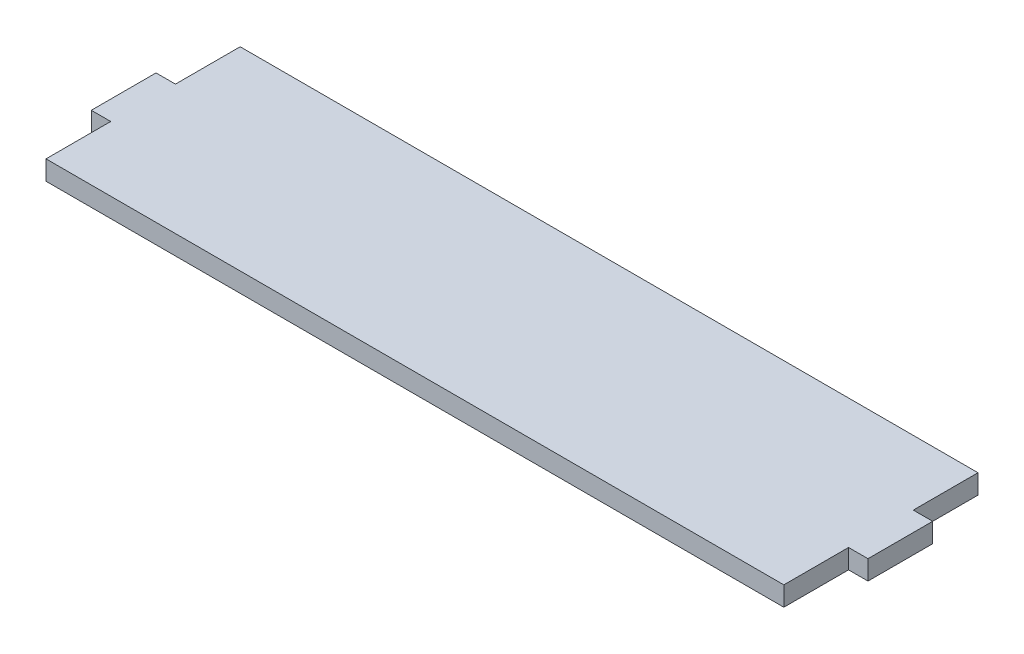
ISO-10303-21;
HEADER;
FILE_DESCRIPTION(('STEP AP214'),'2;1');
FILE_NAME('part.step','',(''),(''),'','','');
FILE_SCHEMA(('AUTOMOTIVE_DESIGN { 1 0 10303 214 1 1 1 1 }'));
ENDSEC;
DATA;
#1=APPLICATION_CONTEXT('core data for automotive mechanical design processes');
#2=APPLICATION_PROTOCOL_DEFINITION('international standard','automotive_design',2000,#1);
#3=PRODUCT_CONTEXT('',#1,'mechanical');
#4=PRODUCT('Part','Part','',(#3));
#5=PRODUCT_RELATED_PRODUCT_CATEGORY('part','',(#4));
#6=PRODUCT_DEFINITION_FORMATION('','',#4);
#7=PRODUCT_DEFINITION_CONTEXT('part definition',#1,'design');
#8=PRODUCT_DEFINITION('design','',#6,#7);
#9=PRODUCT_DEFINITION_SHAPE('','',#8);
#10=(LENGTH_UNIT() NAMED_UNIT(*) SI_UNIT(.MILLI.,.METRE.));
#11=(NAMED_UNIT(*) PLANE_ANGLE_UNIT() SI_UNIT($,.RADIAN.));
#12=(NAMED_UNIT(*) SI_UNIT($,.STERADIAN.) SOLID_ANGLE_UNIT());
#13=UNCERTAINTY_MEASURE_WITH_UNIT(LENGTH_MEASURE(1.E-05),#10,'distance_accuracy_value','');
#14=(GEOMETRIC_REPRESENTATION_CONTEXT(3) GLOBAL_UNCERTAINTY_ASSIGNED_CONTEXT((#13)) GLOBAL_UNIT_ASSIGNED_CONTEXT((#10,
#11,#12)) REPRESENTATION_CONTEXT('',''));
#15=CARTESIAN_POINT('',(0.,0.,0.));
#16=DIRECTION('',(0.,0.,1.));
#17=DIRECTION('',(1.,0.,0.));
#18=AXIS2_PLACEMENT_3D('',#15,#16,#17);
#19=CARTESIAN_POINT('',(-57.,3.,-4.99999999999996));
#20=DIRECTION('',(1.,0.,0.));
#21=DIRECTION('',(0.,0.,-1.));
#22=AXIS2_PLACEMENT_3D('',#19,#20,#21);
#23=PLANE('',#22);
#24=DIRECTION('',(0.,0.,1.));
#25=VECTOR('',#24,1.);
#26=CARTESIAN_POINT('',(-57.,0.,-4.99999999999996));
#27=LINE('',#26,#25);
#28=CARTESIAN_POINT('',(-57.,0.,-15.));
#29=VERTEX_POINT('',#28);
#30=CARTESIAN_POINT('',(-57.,0.,-4.99999999999996));
#31=VERTEX_POINT('',#30);
#32=EDGE_CURVE('E155',#29,#31,#27,.T.);
#33=ORIENTED_EDGE('',*,*,#32,.T.);
#34=DIRECTION('',(0.,-1.,0.));
#35=VECTOR('',#34,1.);
#36=CARTESIAN_POINT('',(-57.,3.,-4.99999999999996));
#37=LINE('',#36,#35);
#38=CARTESIAN_POINT('',(-57.,3.,-4.99999999999996));
#39=VERTEX_POINT('',#38);
#40=EDGE_CURVE('E11',#39,#31,#37,.T.);
#41=ORIENTED_EDGE('',*,*,#40,.F.);
#42=DIRECTION('',(0.,0.,1.));
#43=VECTOR('',#42,1.);
#44=CARTESIAN_POINT('',(-57.,3.,-4.99999999999996));
#45=LINE('',#44,#43);
#46=CARTESIAN_POINT('',(-57.,3.,-15.));
#47=VERTEX_POINT('',#46);
#48=EDGE_CURVE('E177',#47,#39,#45,.T.);
#49=ORIENTED_EDGE('',*,*,#48,.F.);
#50=DIRECTION('',(0.,-1.,0.));
#51=VECTOR('',#50,1.);
#52=CARTESIAN_POINT('',(-57.,3.,-15.));
#53=LINE('',#52,#51);
#54=EDGE_CURVE('E151',#47,#29,#53,.T.);
#55=ORIENTED_EDGE('',*,*,#54,.T.);
#56=EDGE_LOOP('',(#33,#41,#49,#55));
#57=FACE_BOUND('',#56,.T.);
#58=ADVANCED_FACE('F35',(#57),#23,.F.);
#59=CARTESIAN_POINT('',(-57.,3.,-4.99999999999996));
#60=DIRECTION('',(0.,0.,1.));
#61=DIRECTION('',(1.,0.,0.));
#62=AXIS2_PLACEMENT_3D('',#59,#60,#61);
#63=PLANE('',#62);
#64=DIRECTION('',(-1.,0.,0.));
#65=VECTOR('',#64,1.);
#66=CARTESIAN_POINT('',(-57.,0.,-4.99999999999996));
#67=LINE('',#66,#65);
#68=CARTESIAN_POINT('',(-60.,0.,-5.));
#69=VERTEX_POINT('',#68);
#70=EDGE_CURVE('E158',#31,#69,#67,.T.);
#71=ORIENTED_EDGE('',*,*,#70,.T.);
#72=DIRECTION('',(0.,-1.,0.));
#73=VECTOR('',#72,1.);
#74=CARTESIAN_POINT('',(-60.,3.,-5.));
#75=LINE('',#74,#73);
#76=CARTESIAN_POINT('',(-60.,3.,-5.));
#77=VERTEX_POINT('',#76);
#78=EDGE_CURVE('E43',#77,#69,#75,.T.);
#79=ORIENTED_EDGE('',*,*,#78,.F.);
#80=DIRECTION('',(-1.,0.,0.));
#81=VECTOR('',#80,1.);
#82=CARTESIAN_POINT('',(-57.,3.,-4.99999999999996));
#83=LINE('',#82,#81);
#84=EDGE_CURVE('E106',#39,#77,#83,.T.);
#85=ORIENTED_EDGE('',*,*,#84,.F.);
#86=ORIENTED_EDGE('',*,*,#40,.T.);
#87=EDGE_LOOP('',(#71,#79,#85,#86));
#88=FACE_BOUND('',#87,.T.);
#89=ADVANCED_FACE('F255',(#88),#63,.F.);
#90=CARTESIAN_POINT('',(-60.,3.,-5.));
#91=DIRECTION('',(1.,0.,0.));
#92=DIRECTION('',(0.,0.,-1.));
#93=AXIS2_PLACEMENT_3D('',#90,#91,#92);
#94=PLANE('',#93);
#95=DIRECTION('',(0.,0.,1.));
#96=VECTOR('',#95,1.);
#97=CARTESIAN_POINT('',(-60.,0.,-5.));
#98=LINE('',#97,#96);
#99=CARTESIAN_POINT('',(-60.,0.,5.));
#100=VERTEX_POINT('',#99);
#101=EDGE_CURVE('E160',#69,#100,#98,.T.);
#102=ORIENTED_EDGE('',*,*,#101,.T.);
#103=DIRECTION('',(0.,-1.,0.));
#104=VECTOR('',#103,1.);
#105=CARTESIAN_POINT('',(-60.,3.,5.));
#106=LINE('',#105,#104);
#107=CARTESIAN_POINT('',(-60.,3.,5.));
#108=VERTEX_POINT('',#107);
#109=EDGE_CURVE('E196',#108,#100,#106,.T.);
#110=ORIENTED_EDGE('',*,*,#109,.F.);
#111=DIRECTION('',(0.,0.,1.));
#112=VECTOR('',#111,1.);
#113=CARTESIAN_POINT('',(-60.,3.,-5.));
#114=LINE('',#113,#112);
#115=EDGE_CURVE('E204',#77,#108,#114,.T.);
#116=ORIENTED_EDGE('',*,*,#115,.F.);
#117=ORIENTED_EDGE('',*,*,#78,.T.);
#118=EDGE_LOOP('',(#102,#110,#116,#117));
#119=FACE_BOUND('',#118,.T.);
#120=ADVANCED_FACE('F202',(#119),#94,.F.);
#121=CARTESIAN_POINT('',(-60.,3.,5.));
#122=DIRECTION('',(0.,0.,-1.));
#123=DIRECTION('',(-1.,0.,0.));
#124=AXIS2_PLACEMENT_3D('',#121,#122,#123);
#125=PLANE('',#124);
#126=DIRECTION('',(1.,0.,0.));
#127=VECTOR('',#126,1.);
#128=CARTESIAN_POINT('',(-60.,0.,5.));
#129=LINE('',#128,#127);
#130=CARTESIAN_POINT('',(-57.,0.,4.99999999999995));
#131=VERTEX_POINT('',#130);
#132=EDGE_CURVE('E162',#100,#131,#129,.T.);
#133=ORIENTED_EDGE('',*,*,#132,.T.);
#134=DIRECTION('',(0.,-1.,0.));
#135=VECTOR('',#134,1.);
#136=CARTESIAN_POINT('',(-57.,3.,4.99999999999995));
#137=LINE('',#136,#135);
#138=CARTESIAN_POINT('',(-57.,3.,4.99999999999995));
#139=VERTEX_POINT('',#138);
#140=EDGE_CURVE('E193',#139,#131,#137,.T.);
#141=ORIENTED_EDGE('',*,*,#140,.F.);
#142=DIRECTION('',(1.,0.,0.));
#143=VECTOR('',#142,1.);
#144=CARTESIAN_POINT('',(-60.,3.,5.));
#145=LINE('',#144,#143);
#146=EDGE_CURVE('E222',#108,#139,#145,.T.);
#147=ORIENTED_EDGE('',*,*,#146,.F.);
#148=ORIENTED_EDGE('',*,*,#109,.T.);
#149=EDGE_LOOP('',(#133,#141,#147,#148));
#150=FACE_BOUND('',#149,.T.);
#151=ADVANCED_FACE('F213',(#150),#125,.F.);
#152=CARTESIAN_POINT('',(-57.,3.,15.));
#153=DIRECTION('',(1.,0.,0.));
#154=DIRECTION('',(0.,0.,-1.));
#155=AXIS2_PLACEMENT_3D('',#152,#153,#154);
#156=PLANE('',#155);
#157=DIRECTION('',(0.,0.,1.));
#158=VECTOR('',#157,1.);
#159=CARTESIAN_POINT('',(-57.,0.,15.));
#160=LINE('',#159,#158);
#161=CARTESIAN_POINT('',(-57.,0.,15.));
#162=VERTEX_POINT('',#161);
#163=EDGE_CURVE('E164',#131,#162,#160,.T.);
#164=ORIENTED_EDGE('',*,*,#163,.T.);
#165=DIRECTION('',(0.,-1.,0.));
#166=VECTOR('',#165,1.);
#167=CARTESIAN_POINT('',(-57.,3.,15.));
#168=LINE('',#167,#166);
#169=CARTESIAN_POINT('',(-57.,3.,15.));
#170=VERTEX_POINT('',#169);
#171=EDGE_CURVE('E190',#170,#162,#168,.T.);
#172=ORIENTED_EDGE('',*,*,#171,.F.);
#173=DIRECTION('',(0.,0.,1.));
#174=VECTOR('',#173,1.);
#175=CARTESIAN_POINT('',(-57.,3.,15.));
#176=LINE('',#175,#174);
#177=EDGE_CURVE('E219',#139,#170,#176,.T.);
#178=ORIENTED_EDGE('',*,*,#177,.F.);
#179=ORIENTED_EDGE('',*,*,#140,.T.);
#180=EDGE_LOOP('',(#164,#172,#178,#179));
#181=FACE_BOUND('',#180,.T.);
#182=ADVANCED_FACE('F217',(#181),#156,.F.);
#183=CARTESIAN_POINT('',(57.,3.,15.));
#184=DIRECTION('',(0.,0.,-1.));
#185=DIRECTION('',(-1.,0.,0.));
#186=AXIS2_PLACEMENT_3D('',#183,#184,#185);
#187=PLANE('',#186);
#188=DIRECTION('',(1.,0.,0.));
#189=VECTOR('',#188,1.);
#190=CARTESIAN_POINT('',(57.,0.,15.));
#191=LINE('',#190,#189);
#192=CARTESIAN_POINT('',(57.,0.,15.));
#193=VERTEX_POINT('',#192);
#194=EDGE_CURVE('E166',#162,#193,#191,.T.);
#195=ORIENTED_EDGE('',*,*,#194,.T.);
#196=DIRECTION('',(0.,-1.,0.));
#197=VECTOR('',#196,1.);
#198=CARTESIAN_POINT('',(57.,3.,15.));
#199=LINE('',#198,#197);
#200=CARTESIAN_POINT('',(57.,3.,15.));
#201=VERTEX_POINT('',#200);
#202=EDGE_CURVE('E187',#201,#193,#199,.T.);
#203=ORIENTED_EDGE('',*,*,#202,.F.);
#204=DIRECTION('',(1.,0.,0.));
#205=VECTOR('',#204,1.);
#206=CARTESIAN_POINT('',(57.,3.,15.));
#207=LINE('',#206,#205);
#208=EDGE_CURVE('E221',#170,#201,#207,.T.);
#209=ORIENTED_EDGE('',*,*,#208,.F.);
#210=ORIENTED_EDGE('',*,*,#171,.T.);
#211=EDGE_LOOP('',(#195,#203,#209,#210));
#212=FACE_BOUND('',#211,.T.);
#213=ADVANCED_FACE('F268',(#212),#187,.F.);
#214=CARTESIAN_POINT('',(57.,3.,15.));
#215=DIRECTION('',(-1.,0.,0.));
#216=DIRECTION('',(0.,0.,1.));
#217=AXIS2_PLACEMENT_3D('',#214,#215,#216);
#218=PLANE('',#217);
#219=DIRECTION('',(0.,0.,-1.));
#220=VECTOR('',#219,1.);
#221=CARTESIAN_POINT('',(57.,0.,15.));
#222=LINE('',#221,#220);
#223=CARTESIAN_POINT('',(57.,0.,4.99999999999994));
#224=VERTEX_POINT('',#223);
#225=EDGE_CURVE('E168',#193,#224,#222,.T.);
#226=ORIENTED_EDGE('',*,*,#225,.T.);
#227=DIRECTION('',(0.,-1.,0.));
#228=VECTOR('',#227,1.);
#229=CARTESIAN_POINT('',(57.,3.,4.99999999999994));
#230=LINE('',#229,#228);
#231=CARTESIAN_POINT('',(57.,3.,4.99999999999994));
#232=VERTEX_POINT('',#231);
#233=EDGE_CURVE('E184',#232,#224,#230,.T.);
#234=ORIENTED_EDGE('',*,*,#233,.F.);
#235=DIRECTION('',(0.,0.,-1.));
#236=VECTOR('',#235,1.);
#237=CARTESIAN_POINT('',(57.,3.,15.));
#238=LINE('',#237,#236);
#239=EDGE_CURVE('E224',#201,#232,#238,.T.);
#240=ORIENTED_EDGE('',*,*,#239,.F.);
#241=ORIENTED_EDGE('',*,*,#202,.T.);
#242=EDGE_LOOP('',(#226,#234,#240,#241));
#243=FACE_BOUND('',#242,.T.);
#244=ADVANCED_FACE('F271',(#243),#218,.F.);
#245=CARTESIAN_POINT('',(60.,3.,4.99999999999998));
#246=DIRECTION('',(0.,0.,-1.));
#247=DIRECTION('',(-1.,0.,0.));
#248=AXIS2_PLACEMENT_3D('',#245,#246,#247);
#249=PLANE('',#248);
#250=DIRECTION('',(1.,0.,0.));
#251=VECTOR('',#250,1.);
#252=CARTESIAN_POINT('',(60.,0.,4.99999999999998));
#253=LINE('',#252,#251);
#254=CARTESIAN_POINT('',(60.,0.,4.99999999999998));
#255=VERTEX_POINT('',#254);
#256=EDGE_CURVE('E170',#224,#255,#253,.T.);
#257=ORIENTED_EDGE('',*,*,#256,.T.);
#258=DIRECTION('',(0.,-1.,0.));
#259=VECTOR('',#258,1.);
#260=CARTESIAN_POINT('',(60.,3.,4.99999999999998));
#261=LINE('',#260,#259);
#262=CARTESIAN_POINT('',(60.,3.,4.99999999999998));
#263=VERTEX_POINT('',#262);
#264=EDGE_CURVE('E181',#263,#255,#261,.T.);
#265=ORIENTED_EDGE('',*,*,#264,.F.);
#266=DIRECTION('',(1.,0.,0.));
#267=VECTOR('',#266,1.);
#268=CARTESIAN_POINT('',(60.,3.,4.99999999999998));
#269=LINE('',#268,#267);
#270=EDGE_CURVE('E230',#232,#263,#269,.T.);
#271=ORIENTED_EDGE('',*,*,#270,.F.);
#272=ORIENTED_EDGE('',*,*,#233,.T.);
#273=EDGE_LOOP('',(#257,#265,#271,#272));
#274=FACE_BOUND('',#273,.T.);
#275=ADVANCED_FACE('F236',(#274),#249,.F.);
#276=CARTESIAN_POINT('',(60.,3.,-4.99999999999999));
#277=DIRECTION('',(-1.,0.,0.));
#278=DIRECTION('',(0.,0.,1.));
#279=AXIS2_PLACEMENT_3D('',#276,#277,#278);
#280=PLANE('',#279);
#281=DIRECTION('',(0.,0.,-1.));
#282=VECTOR('',#281,1.);
#283=CARTESIAN_POINT('',(60.,0.,-4.99999999999999));
#284=LINE('',#283,#282);
#285=CARTESIAN_POINT('',(60.,0.,-4.99999999999999));
#286=VERTEX_POINT('',#285);
#287=EDGE_CURVE('E172',#255,#286,#284,.T.);
#288=ORIENTED_EDGE('',*,*,#287,.T.);
#289=DIRECTION('',(0.,-1.,0.));
#290=VECTOR('',#289,1.);
#291=CARTESIAN_POINT('',(60.,3.,-4.99999999999999));
#292=LINE('',#291,#290);
#293=CARTESIAN_POINT('',(60.,3.,-4.99999999999999));
#294=VERTEX_POINT('',#293);
#295=EDGE_CURVE('E146',#294,#286,#292,.T.);
#296=ORIENTED_EDGE('',*,*,#295,.F.);
#297=DIRECTION('',(0.,0.,-1.));
#298=VECTOR('',#297,1.);
#299=CARTESIAN_POINT('',(60.,3.,-4.99999999999999));
#300=LINE('',#299,#298);
#301=EDGE_CURVE('E137',#263,#294,#300,.T.);
#302=ORIENTED_EDGE('',*,*,#301,.F.);
#303=ORIENTED_EDGE('',*,*,#264,.T.);
#304=EDGE_LOOP('',(#288,#296,#302,#303));
#305=FACE_BOUND('',#304,.T.);
#306=ADVANCED_FACE('F240',(#305),#280,.F.);
#307=CARTESIAN_POINT('',(57.,3.,-4.99999999999994));
#308=DIRECTION('',(0.,0.,1.));
#309=DIRECTION('',(1.,0.,0.));
#310=AXIS2_PLACEMENT_3D('',#307,#308,#309);
#311=PLANE('',#310);
#312=DIRECTION('',(-1.,0.,0.));
#313=VECTOR('',#312,1.);
#314=CARTESIAN_POINT('',(57.,0.,-4.99999999999994));
#315=LINE('',#314,#313);
#316=CARTESIAN_POINT('',(57.,0.,-4.99999999999994));
#317=VERTEX_POINT('',#316);
#318=EDGE_CURVE('E145',#286,#317,#315,.T.);
#319=ORIENTED_EDGE('',*,*,#318,.T.);
#320=DIRECTION('',(0.,-1.,0.));
#321=VECTOR('',#320,1.);
#322=CARTESIAN_POINT('',(57.,3.,-4.99999999999994));
#323=LINE('',#322,#321);
#324=CARTESIAN_POINT('',(57.,3.,-4.99999999999994));
#325=VERTEX_POINT('',#324);
#326=EDGE_CURVE('E142',#325,#317,#323,.T.);
#327=ORIENTED_EDGE('',*,*,#326,.F.);
#328=DIRECTION('',(-1.,0.,0.));
#329=VECTOR('',#328,1.);
#330=CARTESIAN_POINT('',(57.,3.,-4.99999999999994));
#331=LINE('',#330,#329);
#332=EDGE_CURVE('E131',#294,#325,#331,.T.);
#333=ORIENTED_EDGE('',*,*,#332,.F.);
#334=ORIENTED_EDGE('',*,*,#295,.T.);
#335=EDGE_LOOP('',(#319,#327,#333,#334));
#336=FACE_BOUND('',#335,.T.);
#337=ADVANCED_FACE('F143',(#336),#311,.F.);
#338=CARTESIAN_POINT('',(57.,3.,-4.99999999999994));
#339=DIRECTION('',(-1.,0.,0.));
#340=DIRECTION('',(0.,0.,1.));
#341=AXIS2_PLACEMENT_3D('',#338,#339,#340);
#342=PLANE('',#341);
#343=DIRECTION('',(0.,0.,-1.));
#344=VECTOR('',#343,1.);
#345=CARTESIAN_POINT('',(57.,0.,-4.99999999999994));
#346=LINE('',#345,#344);
#347=CARTESIAN_POINT('',(57.,0.,-15.));
#348=VERTEX_POINT('',#347);
#349=EDGE_CURVE('E92',#317,#348,#346,.T.);
#350=ORIENTED_EDGE('',*,*,#349,.T.);
#351=DIRECTION('',(0.,-1.,0.));
#352=VECTOR('',#351,1.);
#353=CARTESIAN_POINT('',(57.,3.,-15.));
#354=LINE('',#353,#352);
#355=CARTESIAN_POINT('',(57.,3.,-15.));
#356=VERTEX_POINT('',#355);
#357=EDGE_CURVE('E147',#356,#348,#354,.T.);
#358=ORIENTED_EDGE('',*,*,#357,.F.);
#359=DIRECTION('',(0.,0.,-1.));
#360=VECTOR('',#359,1.);
#361=CARTESIAN_POINT('',(57.,3.,-4.99999999999994));
#362=LINE('',#361,#360);
#363=EDGE_CURVE('E135',#325,#356,#362,.T.);
#364=ORIENTED_EDGE('',*,*,#363,.F.);
#365=ORIENTED_EDGE('',*,*,#326,.T.);
#366=EDGE_LOOP('',(#350,#358,#364,#365));
#367=FACE_BOUND('',#366,.T.);
#368=ADVANCED_FACE('F149',(#367),#342,.F.);
#369=CARTESIAN_POINT('',(57.,3.,-15.));
#370=DIRECTION('',(0.,0.,1.));
#371=DIRECTION('',(1.,0.,0.));
#372=AXIS2_PLACEMENT_3D('',#369,#370,#371);
#373=PLANE('',#372);
#374=DIRECTION('',(-1.,0.,0.));
#375=VECTOR('',#374,1.);
#376=CARTESIAN_POINT('',(57.,0.,-15.));
#377=LINE('',#376,#375);
#378=EDGE_CURVE('E98',#348,#29,#377,.T.);
#379=ORIENTED_EDGE('',*,*,#378,.T.);
#380=ORIENTED_EDGE('',*,*,#54,.F.);
#381=DIRECTION('',(-1.,0.,0.));
#382=VECTOR('',#381,1.);
#383=CARTESIAN_POINT('',(57.,3.,-15.));
#384=LINE('',#383,#382);
#385=EDGE_CURVE('E51',#356,#47,#384,.T.);
#386=ORIENTED_EDGE('',*,*,#385,.F.);
#387=ORIENTED_EDGE('',*,*,#357,.T.);
#388=EDGE_LOOP('',(#379,#380,#386,#387));
#389=FACE_BOUND('',#388,.T.);
#390=ADVANCED_FACE('F244',(#389),#373,.F.);
#391=CARTESIAN_POINT('',(0.,3.,0.));
#392=DIRECTION('',(0.,1.,0.));
#393=DIRECTION('',(0.,0.,1.));
#394=AXIS2_PLACEMENT_3D('',#391,#392,#393);
#395=PLANE('',#394);
#396=ORIENTED_EDGE('',*,*,#48,.T.);
#397=ORIENTED_EDGE('',*,*,#84,.T.);
#398=ORIENTED_EDGE('',*,*,#115,.T.);
#399=ORIENTED_EDGE('',*,*,#146,.T.);
#400=ORIENTED_EDGE('',*,*,#177,.T.);
#401=ORIENTED_EDGE('',*,*,#208,.T.);
#402=ORIENTED_EDGE('',*,*,#239,.T.);
#403=ORIENTED_EDGE('',*,*,#270,.T.);
#404=ORIENTED_EDGE('',*,*,#301,.T.);
#405=ORIENTED_EDGE('',*,*,#332,.T.);
#406=ORIENTED_EDGE('',*,*,#363,.T.);
#407=ORIENTED_EDGE('',*,*,#385,.T.);
#408=EDGE_LOOP('',(#396,#397,#398,#399,#400,#401,#402,#403,#404,#405,#406,#407));
#409=FACE_BOUND('',#408,.T.);
#410=ADVANCED_FACE('F133',(#409),#395,.T.);
#411=CARTESIAN_POINT('',(0.,0.,0.));
#412=DIRECTION('',(0.,1.,0.));
#413=DIRECTION('',(0.,0.,1.));
#414=AXIS2_PLACEMENT_3D('',#411,#412,#413);
#415=PLANE('',#414);
#416=ORIENTED_EDGE('',*,*,#32,.F.);
#417=ORIENTED_EDGE('',*,*,#378,.F.);
#418=ORIENTED_EDGE('',*,*,#349,.F.);
#419=ORIENTED_EDGE('',*,*,#318,.F.);
#420=ORIENTED_EDGE('',*,*,#287,.F.);
#421=ORIENTED_EDGE('',*,*,#256,.F.);
#422=ORIENTED_EDGE('',*,*,#225,.F.);
#423=ORIENTED_EDGE('',*,*,#194,.F.);
#424=ORIENTED_EDGE('',*,*,#163,.F.);
#425=ORIENTED_EDGE('',*,*,#132,.F.);
#426=ORIENTED_EDGE('',*,*,#101,.F.);
#427=ORIENTED_EDGE('',*,*,#70,.F.);
#428=EDGE_LOOP('',(#416,#417,#418,#419,#420,#421,#422,#423,#424,#425,#426,#427));
#429=FACE_BOUND('',#428,.T.);
#430=ADVANCED_FACE('F208',(#429),#415,.F.);
#431=CLOSED_SHELL('',(#58,#89,#120,#151,#182,#213,#244,#275,#306,#337,#368,#390,#410,#430));
#432=MANIFOLD_SOLID_BREP('B2',#431);
#433=ADVANCED_BREP_SHAPE_REPRESENTATION('',(#18,#432),#14);
#434=SHAPE_DEFINITION_REPRESENTATION(#9,#433);
ENDSEC;
END-ISO-10303-21;
